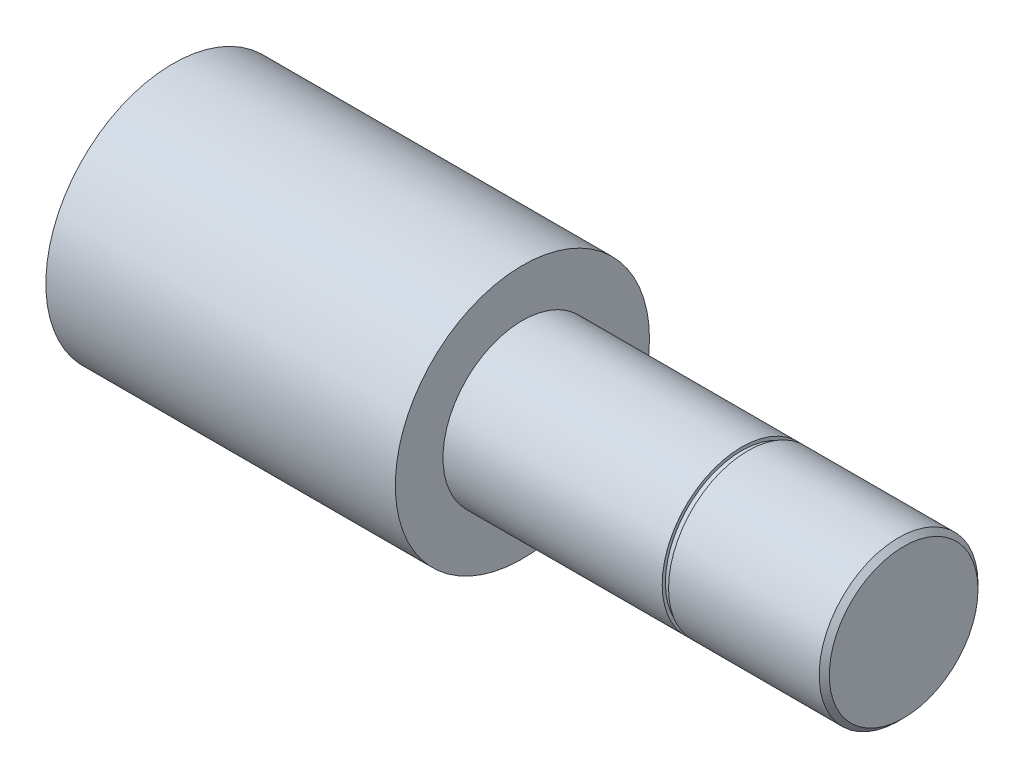
ISO-10303-21;
HEADER;
FILE_DESCRIPTION(('STEP AP214'),'2;1');
FILE_NAME('part.step','',(''),(''),'','','');
FILE_SCHEMA(('AUTOMOTIVE_DESIGN { 1 0 10303 214 1 1 1 1 }'));
ENDSEC;
DATA;
#1=APPLICATION_CONTEXT('core data for automotive mechanical design processes');
#2=APPLICATION_PROTOCOL_DEFINITION('international standard','automotive_design',2000,#1);
#3=PRODUCT_CONTEXT('',#1,'mechanical');
#4=PRODUCT('Part','Part','',(#3));
#5=PRODUCT_RELATED_PRODUCT_CATEGORY('part','',(#4));
#6=PRODUCT_DEFINITION_FORMATION('','',#4);
#7=PRODUCT_DEFINITION_CONTEXT('part definition',#1,'design');
#8=PRODUCT_DEFINITION('design','',#6,#7);
#9=PRODUCT_DEFINITION_SHAPE('','',#8);
#10=(LENGTH_UNIT() NAMED_UNIT(*) SI_UNIT(.MILLI.,.METRE.));
#11=(NAMED_UNIT(*) PLANE_ANGLE_UNIT() SI_UNIT($,.RADIAN.));
#12=(NAMED_UNIT(*) SI_UNIT($,.STERADIAN.) SOLID_ANGLE_UNIT());
#13=UNCERTAINTY_MEASURE_WITH_UNIT(LENGTH_MEASURE(1.E-05),#10,'distance_accuracy_value','');
#14=(GEOMETRIC_REPRESENTATION_CONTEXT(3) GLOBAL_UNCERTAINTY_ASSIGNED_CONTEXT((#13)) GLOBAL_UNIT_ASSIGNED_CONTEXT((#10,
#11,#12)) REPRESENTATION_CONTEXT('',''));
#15=CARTESIAN_POINT('',(0.,0.,0.));
#16=DIRECTION('',(0.,0.,1.));
#17=DIRECTION('',(1.,0.,0.));
#18=AXIS2_PLACEMENT_3D('',#15,#16,#17);
#19=CARTESIAN_POINT('',(0.,0.,0.));
#20=DIRECTION('',(1.,0.,0.));
#21=DIRECTION('',(0.,0.,-1.));
#22=AXIS2_PLACEMENT_3D('',#19,#20,#21);
#23=CYLINDRICAL_SURFACE('',#22,12.5);
#24=CARTESIAN_POINT('',(55.,0.,0.));
#25=DIRECTION('',(1.,0.,0.));
#26=DIRECTION('',(0.,0.,-1.));
#27=AXIS2_PLACEMENT_3D('',#24,#25,#26);
#28=CIRCLE('',#27,12.5);
#29=CARTESIAN_POINT('',(55.,0.,-12.5));
#30=VERTEX_POINT('',#29);
#31=EDGE_CURVE('E45',#30,#30,#28,.T.);
#32=ORIENTED_EDGE('',*,*,#31,.T.);
#33=EDGE_LOOP('',(#32));
#34=FACE_BOUND('',#33,.T.);
#35=CARTESIAN_POINT('',(89.5000000000001,0.,0.));
#36=DIRECTION('',(-1.,0.,0.));
#37=DIRECTION('',(0.,0.,1.));
#38=AXIS2_PLACEMENT_3D('',#35,#36,#37);
#39=CIRCLE('',#38,12.5);
#40=CARTESIAN_POINT('',(89.5000000000001,0.,12.5));
#41=VERTEX_POINT('',#40);
#42=EDGE_CURVE('E53',#41,#41,#39,.T.);
#43=ORIENTED_EDGE('',*,*,#42,.T.);
#44=EDGE_LOOP('',(#43));
#45=FACE_BOUND('',#44,.T.);
#46=ADVANCED_FACE('F30',(#34,#45),#23,.T.);
#47=CARTESIAN_POINT('',(0.,0.,0.));
#48=DIRECTION('',(1.,0.,0.));
#49=DIRECTION('',(0.,0.,-1.));
#50=AXIS2_PLACEMENT_3D('',#47,#48,#49);
#51=CYLINDRICAL_SURFACE('',#50,20.);
#52=CARTESIAN_POINT('',(0.,0.,0.));
#53=DIRECTION('',(1.,0.,0.));
#54=DIRECTION('',(0.,0.,-1.));
#55=AXIS2_PLACEMENT_3D('',#52,#53,#54);
#56=CIRCLE('',#55,20.);
#57=CARTESIAN_POINT('',(0.,0.,-20.));
#58=VERTEX_POINT('',#57);
#59=EDGE_CURVE('E10',#58,#58,#56,.T.);
#60=ORIENTED_EDGE('',*,*,#59,.T.);
#61=EDGE_LOOP('',(#60));
#62=FACE_BOUND('',#61,.T.);
#63=CARTESIAN_POINT('',(55.,0.,0.));
#64=DIRECTION('',(1.,0.,0.));
#65=DIRECTION('',(0.,0.,-1.));
#66=AXIS2_PLACEMENT_3D('',#63,#64,#65);
#67=CIRCLE('',#66,20.);
#68=CARTESIAN_POINT('',(55.,0.,-20.));
#69=VERTEX_POINT('',#68);
#70=EDGE_CURVE('E50',#69,#69,#67,.T.);
#71=ORIENTED_EDGE('',*,*,#70,.F.);
#72=EDGE_LOOP('',(#71));
#73=FACE_BOUND('',#72,.T.);
#74=ADVANCED_FACE('F32',(#62,#73),#51,.T.);
#75=CARTESIAN_POINT('',(0.,20.,0.));
#76=DIRECTION('',(-1.,0.,0.));
#77=DIRECTION('',(0.,0.,1.));
#78=AXIS2_PLACEMENT_3D('',#75,#76,#77);
#79=PLANE('',#78);
#80=ORIENTED_EDGE('',*,*,#59,.F.);
#81=EDGE_LOOP('',(#80));
#82=FACE_BOUND('',#81,.T.);
#83=ADVANCED_FACE('F87',(#82),#79,.T.);
#84=CARTESIAN_POINT('',(55.,12.5,0.));
#85=DIRECTION('',(1.,0.,0.));
#86=DIRECTION('',(0.,0.,-1.));
#87=AXIS2_PLACEMENT_3D('',#84,#85,#86);
#88=PLANE('',#87);
#89=ORIENTED_EDGE('',*,*,#70,.T.);
#90=EDGE_LOOP('',(#89));
#91=FACE_BOUND('',#90,.T.);
#92=ORIENTED_EDGE('',*,*,#31,.F.);
#93=EDGE_LOOP('',(#92));
#94=FACE_BOUND('',#93,.T.);
#95=ADVANCED_FACE('F95',(#91,#94),#88,.T.);
#96=CARTESIAN_POINT('',(89.5000000000001,12.5,0.));
#97=DIRECTION('',(1.,0.,0.));
#98=DIRECTION('',(0.,0.,-1.));
#99=AXIS2_PLACEMENT_3D('',#96,#97,#98);
#100=PLANE('',#99);
#101=CARTESIAN_POINT('',(89.5000000000001,0.,0.));
#102=DIRECTION('',(-1.,0.,0.));
#103=DIRECTION('',(0.,0.,1.));
#104=AXIS2_PLACEMENT_3D('',#101,#102,#103);
#105=CIRCLE('',#104,12.);
#106=CARTESIAN_POINT('',(89.5000000000001,0.,12.));
#107=VERTEX_POINT('',#106);
#108=EDGE_CURVE('E56',#107,#107,#105,.T.);
#109=ORIENTED_EDGE('',*,*,#108,.T.);
#110=EDGE_LOOP('',(#109));
#111=FACE_BOUND('',#110,.T.);
#112=ORIENTED_EDGE('',*,*,#42,.F.);
#113=EDGE_LOOP('',(#112));
#114=FACE_BOUND('',#113,.T.);
#115=ADVANCED_FACE('F92',(#111,#114),#100,.T.);
#116=CARTESIAN_POINT('',(79.8353492024262,0.,0.));
#117=DIRECTION('',(-1.,0.,0.));
#118=DIRECTION('',(0.,0.,1.));
#119=AXIS2_PLACEMENT_3D('',#116,#117,#118);
#120=CYLINDRICAL_SURFACE('',#119,12.);
#121=CARTESIAN_POINT('',(90.5000000000001,0.,0.));
#122=DIRECTION('',(-1.,0.,0.));
#123=DIRECTION('',(0.,0.,1.));
#124=AXIS2_PLACEMENT_3D('',#121,#122,#123);
#125=CIRCLE('',#124,12.);
#126=CARTESIAN_POINT('',(90.5000000000001,0.,12.));
#127=VERTEX_POINT('',#126);
#128=EDGE_CURVE('E59',#127,#127,#125,.T.);
#129=ORIENTED_EDGE('',*,*,#128,.T.);
#130=EDGE_LOOP('',(#129));
#131=FACE_BOUND('',#130,.T.);
#132=ORIENTED_EDGE('',*,*,#108,.F.);
#133=EDGE_LOOP('',(#132));
#134=FACE_BOUND('',#133,.T.);
#135=ADVANCED_FACE('F94',(#131,#134),#120,.T.);
#136=CARTESIAN_POINT('',(90.5000000000001,12.,0.));
#137=DIRECTION('',(-1.,0.,0.));
#138=DIRECTION('',(0.,0.,1.));
#139=AXIS2_PLACEMENT_3D('',#136,#137,#138);
#140=PLANE('',#139);
#141=CARTESIAN_POINT('',(90.5000000000001,0.,0.));
#142=DIRECTION('',(-1.,0.,0.));
#143=DIRECTION('',(0.,0.,1.));
#144=AXIS2_PLACEMENT_3D('',#141,#142,#143);
#145=CIRCLE('',#144,12.5);
#146=CARTESIAN_POINT('',(90.5000000000001,0.,12.5));
#147=VERTEX_POINT('',#146);
#148=EDGE_CURVE('E62',#147,#147,#145,.T.);
#149=ORIENTED_EDGE('',*,*,#148,.T.);
#150=EDGE_LOOP('',(#149));
#151=FACE_BOUND('',#150,.T.);
#152=ORIENTED_EDGE('',*,*,#128,.F.);
#153=EDGE_LOOP('',(#152));
#154=FACE_BOUND('',#153,.T.);
#155=ADVANCED_FACE('F66',(#151,#154),#140,.T.);
#156=CARTESIAN_POINT('',(115.,0.,0.));
#157=DIRECTION('',(1.,0.,0.));
#158=DIRECTION('',(0.,0.,-1.));
#159=AXIS2_PLACEMENT_3D('',#156,#157,#158);
#160=PLANE('',#159);
#161=CARTESIAN_POINT('',(115.,0.,0.));
#162=DIRECTION('',(1.,0.,0.));
#163=DIRECTION('',(0.,0.,-1.));
#164=AXIS2_PLACEMENT_3D('',#161,#162,#163);
#165=CIRCLE('',#164,11.7);
#166=CARTESIAN_POINT('',(115.,0.,-11.7));
#167=VERTEX_POINT('',#166);
#168=EDGE_CURVE('E37',#167,#167,#165,.T.);
#169=ORIENTED_EDGE('',*,*,#168,.T.);
#170=EDGE_LOOP('',(#169));
#171=FACE_BOUND('',#170,.T.);
#172=ADVANCED_FACE('F77',(#171),#160,.T.);
#173=CARTESIAN_POINT('',(115.,0.,0.));
#174=DIRECTION('',(-1.,0.,0.));
#175=DIRECTION('',(0.,0.,1.));
#176=AXIS2_PLACEMENT_3D('',#173,#174,#175);
#177=CONICAL_SURFACE('',#176,11.7,0.785398163397387);
#178=CARTESIAN_POINT('',(114.2,0.,0.));
#179=DIRECTION('',(1.,0.,0.));
#180=DIRECTION('',(0.,0.,-1.));
#181=AXIS2_PLACEMENT_3D('',#178,#179,#180);
#182=CIRCLE('',#181,12.5);
#183=CARTESIAN_POINT('',(114.2,0.,-12.5));
#184=VERTEX_POINT('',#183);
#185=EDGE_CURVE('E41',#184,#184,#182,.T.);
#186=ORIENTED_EDGE('',*,*,#185,.T.);
#187=EDGE_LOOP('',(#186));
#188=FACE_BOUND('',#187,.T.);
#189=ORIENTED_EDGE('',*,*,#168,.F.);
#190=EDGE_LOOP('',(#189));
#191=FACE_BOUND('',#190,.T.);
#192=ADVANCED_FACE('F71',(#188,#191),#177,.T.);
#193=ORIENTED_EDGE('',*,*,#185,.F.);
#194=EDGE_LOOP('',(#193));
#195=FACE_BOUND('',#194,.T.);
#196=ORIENTED_EDGE('',*,*,#148,.F.);
#197=EDGE_LOOP('',(#196));
#198=FACE_BOUND('',#197,.T.);
#199=ADVANCED_FACE('F69',(#195,#198),#23,.T.);
#200=CLOSED_SHELL('',(#46,#74,#83,#95,#115,#135,#155,#172,#192,#199));
#201=MANIFOLD_SOLID_BREP('B2',#200);
#202=ADVANCED_BREP_SHAPE_REPRESENTATION('',(#18,#201),#14);
#203=SHAPE_DEFINITION_REPRESENTATION(#9,#202);
ENDSEC;
END-ISO-10303-21;
